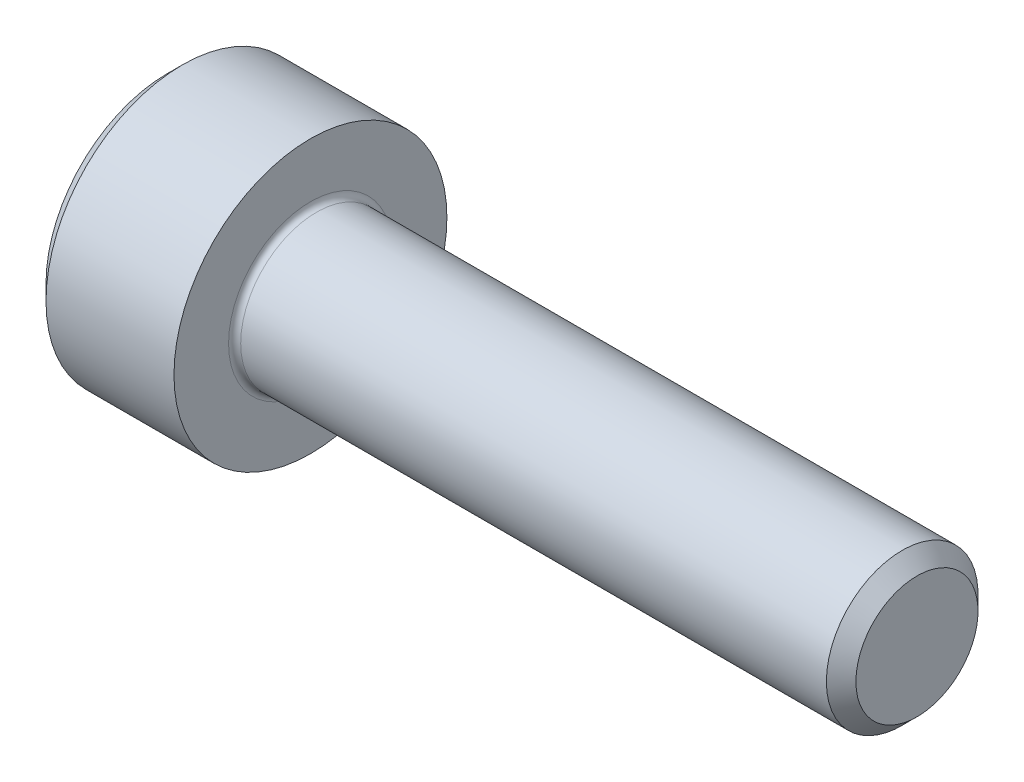
ISO-10303-21;
HEADER;
FILE_DESCRIPTION(('STEP AP214'),'2;1');
FILE_NAME('part.step','',(''),(''),'','','');
FILE_SCHEMA(('AUTOMOTIVE_DESIGN { 1 0 10303 214 1 1 1 1 }'));
ENDSEC;
DATA;
#1=APPLICATION_CONTEXT('core data for automotive mechanical design processes');
#2=APPLICATION_PROTOCOL_DEFINITION('international standard','automotive_design',2000,#1);
#3=PRODUCT_CONTEXT('',#1,'mechanical');
#4=PRODUCT('Part','Part','',(#3));
#5=PRODUCT_RELATED_PRODUCT_CATEGORY('part','',(#4));
#6=PRODUCT_DEFINITION_FORMATION('','',#4);
#7=PRODUCT_DEFINITION_CONTEXT('part definition',#1,'design');
#8=PRODUCT_DEFINITION('design','',#6,#7);
#9=PRODUCT_DEFINITION_SHAPE('','',#8);
#10=(LENGTH_UNIT() NAMED_UNIT(*) SI_UNIT(.MILLI.,.METRE.));
#11=(NAMED_UNIT(*) PLANE_ANGLE_UNIT() SI_UNIT($,.RADIAN.));
#12=(NAMED_UNIT(*) SI_UNIT($,.STERADIAN.) SOLID_ANGLE_UNIT());
#13=UNCERTAINTY_MEASURE_WITH_UNIT(LENGTH_MEASURE(1.E-05),#10,'distance_accuracy_value','');
#14=(GEOMETRIC_REPRESENTATION_CONTEXT(3) GLOBAL_UNCERTAINTY_ASSIGNED_CONTEXT((#13)) GLOBAL_UNIT_ASSIGNED_CONTEXT((#10,
#11,#12)) REPRESENTATION_CONTEXT('',''));
#15=CARTESIAN_POINT('',(0.,0.,0.));
#16=DIRECTION('',(0.,0.,1.));
#17=DIRECTION('',(1.,0.,0.));
#18=AXIS2_PLACEMENT_3D('',#15,#16,#17);
#19=CARTESIAN_POINT('',(-1.26,0.57735026918963,1.));
#20=DIRECTION('',(1.,0.,0.));
#21=DIRECTION('',(0.,0.,-1.));
#22=AXIS2_PLACEMENT_3D('',#19,#20,#21);
#23=PLANE('',#22);
#24=CARTESIAN_POINT('',(-1.26,0.,0.));
#25=DIRECTION('',(-1.,0.,0.));
#26=DIRECTION('',(0.,0.,1.));
#27=AXIS2_PLACEMENT_3D('',#24,#25,#26);
#28=CIRCLE('',#27,1.);
#29=CARTESIAN_POINT('',(-1.26,0.,1.));
#30=VERTEX_POINT('',#29);
#31=CARTESIAN_POINT('',(-1.26,0.866025403784422,0.500000000000029));
#32=VERTEX_POINT('',#31);
#33=EDGE_CURVE('E42',#30,#32,#28,.T.);
#34=ORIENTED_EDGE('',*,*,#33,.F.);
#35=DIRECTION('',(0.,-1.,0.));
#36=VECTOR('',#35,1.);
#37=CARTESIAN_POINT('',(-1.26,0.57735026918963,1.));
#38=LINE('',#37,#36);
#39=CARTESIAN_POINT('',(-1.26,0.57735026918963,1.));
#40=VERTEX_POINT('',#39);
#41=EDGE_CURVE('E155',#40,#30,#38,.T.);
#42=ORIENTED_EDGE('',*,*,#41,.F.);
#43=DIRECTION('',(0.,-0.500000000000029,0.866025403784422));
#44=VECTOR('',#43,1.);
#45=CARTESIAN_POINT('',(-1.26,1.1547005383793,0.));
#46=LINE('',#45,#44);
#47=EDGE_CURVE('E191',#32,#40,#46,.T.);
#48=ORIENTED_EDGE('',*,*,#47,.F.);
#49=EDGE_LOOP('',(#34,#42,#48));
#50=FACE_BOUND('',#49,.T.);
#51=ADVANCED_FACE('F31',(#50),#23,.F.);
#52=CARTESIAN_POINT('',(-1.26,0.866025403784422,-0.500000000000029));
#53=VERTEX_POINT('',#52);
#54=EDGE_CURVE('E11',#32,#53,#28,.T.);
#55=ORIENTED_EDGE('',*,*,#54,.F.);
#56=CARTESIAN_POINT('',(-1.26,1.1547005383793,0.));
#57=VERTEX_POINT('',#56);
#58=EDGE_CURVE('E289',#57,#32,#46,.T.);
#59=ORIENTED_EDGE('',*,*,#58,.F.);
#60=DIRECTION('',(0.,0.500000000000029,0.866025403784422));
#61=VECTOR('',#60,1.);
#62=CARTESIAN_POINT('',(-1.26,0.57735026918963,-1.));
#63=LINE('',#62,#61);
#64=EDGE_CURVE('E170',#53,#57,#63,.T.);
#65=ORIENTED_EDGE('',*,*,#64,.F.);
#66=EDGE_LOOP('',(#55,#59,#65));
#67=FACE_BOUND('',#66,.T.);
#68=ADVANCED_FACE('F119',(#67),#23,.F.);
#69=CARTESIAN_POINT('',(-1.26,0.,-1.));
#70=VERTEX_POINT('',#69);
#71=EDGE_CURVE('E40',#53,#70,#28,.T.);
#72=ORIENTED_EDGE('',*,*,#71,.F.);
#73=CARTESIAN_POINT('',(-1.26,0.57735026918963,-1.));
#74=VERTEX_POINT('',#73);
#75=EDGE_CURVE('E171',#74,#53,#63,.T.);
#76=ORIENTED_EDGE('',*,*,#75,.F.);
#77=DIRECTION('',(0.,1.,0.));
#78=VECTOR('',#77,1.);
#79=CARTESIAN_POINT('',(-1.26,-0.57735026918963,-1.));
#80=LINE('',#79,#78);
#81=EDGE_CURVE('E166',#70,#74,#80,.T.);
#82=ORIENTED_EDGE('',*,*,#81,.F.);
#83=EDGE_LOOP('',(#72,#76,#82));
#84=FACE_BOUND('',#83,.T.);
#85=ADVANCED_FACE('F125',(#84),#23,.F.);
#86=CARTESIAN_POINT('',(-1.26,-0.866025403784422,-0.500000000000029));
#87=VERTEX_POINT('',#86);
#88=EDGE_CURVE('E279',#70,#87,#28,.T.);
#89=ORIENTED_EDGE('',*,*,#88,.F.);
#90=CARTESIAN_POINT('',(-1.26,-0.57735026918963,-1.));
#91=VERTEX_POINT('',#90);
#92=EDGE_CURVE('E167',#91,#70,#80,.T.);
#93=ORIENTED_EDGE('',*,*,#92,.F.);
#94=DIRECTION('',(0.,0.500000000000029,-0.866025403784422));
#95=VECTOR('',#94,1.);
#96=CARTESIAN_POINT('',(-1.26,-1.1547005383793,0.));
#97=LINE('',#96,#95);
#98=EDGE_CURVE('E161',#87,#91,#97,.T.);
#99=ORIENTED_EDGE('',*,*,#98,.F.);
#100=EDGE_LOOP('',(#89,#93,#99));
#101=FACE_BOUND('',#100,.T.);
#102=ADVANCED_FACE('F138',(#101),#23,.F.);
#103=CARTESIAN_POINT('',(-1.26,-0.866025403784442,0.50000000000004));
#104=VERTEX_POINT('',#103);
#105=EDGE_CURVE('E49',#87,#104,#28,.T.);
#106=ORIENTED_EDGE('',*,*,#105,.F.);
#107=CARTESIAN_POINT('',(-1.26,-1.1547005383793,0.));
#108=VERTEX_POINT('',#107);
#109=EDGE_CURVE('E152',#108,#87,#97,.T.);
#110=ORIENTED_EDGE('',*,*,#109,.F.);
#111=DIRECTION('',(0.,-0.500000000000029,-0.866025403784422));
#112=VECTOR('',#111,1.);
#113=CARTESIAN_POINT('',(-1.26,-0.57735026918963,1.));
#114=LINE('',#113,#112);
#115=EDGE_CURVE('E149',#104,#108,#114,.T.);
#116=ORIENTED_EDGE('',*,*,#115,.F.);
#117=EDGE_LOOP('',(#106,#110,#116));
#118=FACE_BOUND('',#117,.T.);
#119=ADVANCED_FACE('F130',(#118),#23,.F.);
#120=EDGE_CURVE('E142',#104,#30,#28,.T.);
#121=ORIENTED_EDGE('',*,*,#120,.F.);
#122=CARTESIAN_POINT('',(-1.26,-0.57735026918963,1.));
#123=VERTEX_POINT('',#122);
#124=EDGE_CURVE('E145',#123,#104,#114,.T.);
#125=ORIENTED_EDGE('',*,*,#124,.F.);
#126=EDGE_CURVE('E146',#30,#123,#38,.T.);
#127=ORIENTED_EDGE('',*,*,#126,.F.);
#128=EDGE_LOOP('',(#121,#125,#127));
#129=FACE_BOUND('',#128,.T.);
#130=ADVANCED_FACE('F121',(#129),#23,.F.);
#131=CARTESIAN_POINT('',(-2.36,0.,0.));
#132=DIRECTION('',(1.,0.,0.));
#133=DIRECTION('',(0.,0.,-1.));
#134=AXIS2_PLACEMENT_3D('',#131,#132,#133);
#135=PLANE('',#134);
#136=CARTESIAN_POINT('',(-2.36,0.,0.));
#137=DIRECTION('',(-1.,0.,0.));
#138=DIRECTION('',(0.,0.,1.));
#139=AXIS2_PLACEMENT_3D('',#136,#137,#138);
#140=CIRCLE('',#139,2.);
#141=CARTESIAN_POINT('',(-2.36,0.,2.));
#142=VERTEX_POINT('',#141);
#143=EDGE_CURVE('E202',#142,#142,#140,.T.);
#144=ORIENTED_EDGE('',*,*,#143,.T.);
#145=EDGE_LOOP('',(#144));
#146=FACE_BOUND('',#145,.T.);
#147=DIRECTION('',(0.,-0.500000000000029,0.866025403784422));
#148=VECTOR('',#147,1.);
#149=CARTESIAN_POINT('',(-2.36,1.1547005383793,0.));
#150=LINE('',#149,#148);
#151=CARTESIAN_POINT('',(-2.36,1.1547005383793,0.));
#152=VERTEX_POINT('',#151);
#153=CARTESIAN_POINT('',(-2.36,0.57735026918963,1.));
#154=VERTEX_POINT('',#153);
#155=EDGE_CURVE('E57',#152,#154,#150,.T.);
#156=ORIENTED_EDGE('',*,*,#155,.T.);
#157=DIRECTION('',(0.,-1.,0.));
#158=VECTOR('',#157,1.);
#159=CARTESIAN_POINT('',(-2.36,0.57735026918963,1.));
#160=LINE('',#159,#158);
#161=CARTESIAN_POINT('',(-2.36,-0.57735026918963,1.));
#162=VERTEX_POINT('',#161);
#163=EDGE_CURVE('E176',#154,#162,#160,.T.);
#164=ORIENTED_EDGE('',*,*,#163,.T.);
#165=DIRECTION('',(0.,-0.500000000000029,-0.866025403784422));
#166=VECTOR('',#165,1.);
#167=CARTESIAN_POINT('',(-2.36,-0.57735026918963,1.));
#168=LINE('',#167,#166);
#169=CARTESIAN_POINT('',(-2.36,-1.1547005383793,0.));
#170=VERTEX_POINT('',#169);
#171=EDGE_CURVE('E179',#162,#170,#168,.T.);
#172=ORIENTED_EDGE('',*,*,#171,.T.);
#173=DIRECTION('',(0.,0.500000000000029,-0.866025403784422));
#174=VECTOR('',#173,1.);
#175=CARTESIAN_POINT('',(-2.36,-1.1547005383793,0.));
#176=LINE('',#175,#174);
#177=CARTESIAN_POINT('',(-2.36,-0.57735026918963,-1.));
#178=VERTEX_POINT('',#177);
#179=EDGE_CURVE('E182',#170,#178,#176,.T.);
#180=ORIENTED_EDGE('',*,*,#179,.T.);
#181=DIRECTION('',(0.,1.,0.));
#182=VECTOR('',#181,1.);
#183=CARTESIAN_POINT('',(-2.36,-0.57735026918963,-1.));
#184=LINE('',#183,#182);
#185=CARTESIAN_POINT('',(-2.36,0.57735026918963,-1.));
#186=VERTEX_POINT('',#185);
#187=EDGE_CURVE('E185',#178,#186,#184,.T.);
#188=ORIENTED_EDGE('',*,*,#187,.T.);
#189=DIRECTION('',(0.,0.500000000000029,0.866025403784422));
#190=VECTOR('',#189,1.);
#191=CARTESIAN_POINT('',(-2.36,0.57735026918963,-1.));
#192=LINE('',#191,#190);
#193=EDGE_CURVE('E188',#186,#152,#192,.T.);
#194=ORIENTED_EDGE('',*,*,#193,.T.);
#195=EDGE_LOOP('',(#156,#164,#172,#180,#188,#194));
#196=FACE_BOUND('',#195,.T.);
#197=ADVANCED_FACE('F129',(#146,#196),#135,.F.);
#198=CARTESIAN_POINT('',(10.,1.0065,0.));
#199=DIRECTION('',(-1.,0.,0.));
#200=DIRECTION('',(0.,0.,1.));
#201=AXIS2_PLACEMENT_3D('',#198,#199,#200);
#202=PLANE('',#201);
#203=CARTESIAN_POINT('',(10.,0.,0.));
#204=DIRECTION('',(-1.,0.,0.));
#205=DIRECTION('',(0.,0.,1.));
#206=AXIS2_PLACEMENT_3D('',#203,#204,#205);
#207=CIRCLE('',#206,1.0065);
#208=CARTESIAN_POINT('',(10.,0.,1.0065));
#209=VERTEX_POINT('',#208);
#210=EDGE_CURVE('E35',#209,#209,#207,.T.);
#211=ORIENTED_EDGE('',*,*,#210,.F.);
#212=EDGE_LOOP('',(#211));
#213=FACE_BOUND('',#212,.T.);
#214=ADVANCED_FACE('F33',(#213),#202,.F.);
#215=CARTESIAN_POINT('',(10.,0.,0.));
#216=DIRECTION('',(-1.,0.,0.));
#217=DIRECTION('',(0.,0.,1.));
#218=AXIS2_PLACEMENT_3D('',#215,#216,#217);
#219=CONICAL_SURFACE('',#218,1.0065,0.785398163397447);
#220=CARTESIAN_POINT('',(9.7565,0.,0.));
#221=DIRECTION('',(-1.,0.,0.));
#222=DIRECTION('',(0.,0.,1.));
#223=AXIS2_PLACEMENT_3D('',#220,#221,#222);
#224=CIRCLE('',#223,1.25);
#225=CARTESIAN_POINT('',(9.7565,0.,1.25));
#226=VERTEX_POINT('',#225);
#227=EDGE_CURVE('E216',#226,#226,#224,.T.);
#228=ORIENTED_EDGE('',*,*,#227,.F.);
#229=EDGE_LOOP('',(#228));
#230=FACE_BOUND('',#229,.T.);
#231=ORIENTED_EDGE('',*,*,#210,.T.);
#232=EDGE_LOOP('',(#231));
#233=FACE_BOUND('',#232,.T.);
#234=ADVANCED_FACE('F223',(#230,#233),#219,.T.);
#235=CARTESIAN_POINT('',(10.,0.,0.));
#236=DIRECTION('',(-1.,0.,0.));
#237=DIRECTION('',(0.,0.,1.));
#238=AXIS2_PLACEMENT_3D('',#235,#236,#237);
#239=CYLINDRICAL_SURFACE('',#238,1.25);
#240=CARTESIAN_POINT('',(0.0999999999999994,0.,0.));
#241=DIRECTION('',(-1.,0.,0.));
#242=DIRECTION('',(0.,0.,1.));
#243=AXIS2_PLACEMENT_3D('',#240,#241,#242);
#244=CIRCLE('',#243,1.25);
#245=CARTESIAN_POINT('',(0.0999999999999994,0.,1.25));
#246=VERTEX_POINT('',#245);
#247=EDGE_CURVE('E214',#246,#246,#244,.T.);
#248=ORIENTED_EDGE('',*,*,#247,.F.);
#249=EDGE_LOOP('',(#248));
#250=FACE_BOUND('',#249,.T.);
#251=ORIENTED_EDGE('',*,*,#227,.T.);
#252=EDGE_LOOP('',(#251));
#253=FACE_BOUND('',#252,.T.);
#254=ADVANCED_FACE('F229',(#250,#253),#239,.T.);
#255=CARTESIAN_POINT('',(0.0999999999999225,0.,0.));
#256=DIRECTION('',(-1.,0.,0.));
#257=DIRECTION('',(0.,0.,1.));
#258=AXIS2_PLACEMENT_3D('',#255,#256,#257);
#259=TOROIDAL_SURFACE('',#258,1.34999999999992,0.0999999999999225);
#260=CARTESIAN_POINT('',(0.,0.,0.));
#261=DIRECTION('',(-1.,0.,0.));
#262=DIRECTION('',(0.,0.,1.));
#263=AXIS2_PLACEMENT_3D('',#260,#261,#262);
#264=CIRCLE('',#263,1.35);
#265=CARTESIAN_POINT('',(0.,0.,1.35));
#266=VERTEX_POINT('',#265);
#267=EDGE_CURVE('E211',#266,#266,#264,.T.);
#268=ORIENTED_EDGE('',*,*,#267,.F.);
#269=EDGE_LOOP('',(#268));
#270=FACE_BOUND('',#269,.T.);
#271=ORIENTED_EDGE('',*,*,#247,.T.);
#272=EDGE_LOOP('',(#271));
#273=FACE_BOUND('',#272,.T.);
#274=ADVANCED_FACE('F234',(#270,#273),#259,.F.);
#275=CARTESIAN_POINT('',(0.,2.25,0.));
#276=DIRECTION('',(-1.,0.,0.));
#277=DIRECTION('',(0.,0.,1.));
#278=AXIS2_PLACEMENT_3D('',#275,#276,#277);
#279=PLANE('',#278);
#280=CARTESIAN_POINT('',(0.,0.,0.));
#281=DIRECTION('',(-1.,0.,0.));
#282=DIRECTION('',(0.,0.,1.));
#283=AXIS2_PLACEMENT_3D('',#280,#281,#282);
#284=CIRCLE('',#283,2.25);
#285=CARTESIAN_POINT('',(0.,0.,2.25));
#286=VERTEX_POINT('',#285);
#287=EDGE_CURVE('E208',#286,#286,#284,.T.);
#288=ORIENTED_EDGE('',*,*,#287,.F.);
#289=EDGE_LOOP('',(#288));
#290=FACE_BOUND('',#289,.T.);
#291=ORIENTED_EDGE('',*,*,#267,.T.);
#292=EDGE_LOOP('',(#291));
#293=FACE_BOUND('',#292,.T.);
#294=ADVANCED_FACE('F240',(#290,#293),#279,.F.);
#295=CARTESIAN_POINT('',(10.,0.,0.));
#296=DIRECTION('',(-1.,0.,0.));
#297=DIRECTION('',(0.,0.,1.));
#298=AXIS2_PLACEMENT_3D('',#295,#296,#297);
#299=CYLINDRICAL_SURFACE('',#298,2.25);
#300=CARTESIAN_POINT('',(-2.11,0.,0.));
#301=DIRECTION('',(-1.,0.,0.));
#302=DIRECTION('',(0.,0.,1.));
#303=AXIS2_PLACEMENT_3D('',#300,#301,#302);
#304=CIRCLE('',#303,2.25);
#305=CARTESIAN_POINT('',(-2.11,0.,2.25));
#306=VERTEX_POINT('',#305);
#307=EDGE_CURVE('E205',#306,#306,#304,.T.);
#308=ORIENTED_EDGE('',*,*,#307,.F.);
#309=EDGE_LOOP('',(#308));
#310=FACE_BOUND('',#309,.T.);
#311=ORIENTED_EDGE('',*,*,#287,.T.);
#312=EDGE_LOOP('',(#311));
#313=FACE_BOUND('',#312,.T.);
#314=ADVANCED_FACE('F244',(#310,#313),#299,.T.);
#315=CARTESIAN_POINT('',(-2.11,0.,0.));
#316=DIRECTION('',(1.,0.,0.));
#317=DIRECTION('',(0.,0.,-1.));
#318=AXIS2_PLACEMENT_3D('',#315,#316,#317);
#319=CONICAL_SURFACE('',#318,2.25,0.785398163397447);
#320=ORIENTED_EDGE('',*,*,#143,.F.);
#321=EDGE_LOOP('',(#320));
#322=FACE_BOUND('',#321,.T.);
#323=ORIENTED_EDGE('',*,*,#307,.T.);
#324=EDGE_LOOP('',(#323));
#325=FACE_BOUND('',#324,.T.);
#326=ADVANCED_FACE('F248',(#322,#325),#319,.T.);
#327=CARTESIAN_POINT('',(-1.26,1.1547005383793,0.));
#328=DIRECTION('',(0.,-0.866025403784422,-0.500000000000029));
#329=DIRECTION('',(0.,0.500000000000029,-0.866025403784422));
#330=AXIS2_PLACEMENT_3D('',#327,#328,#329);
#331=PLANE('',#330);
#332=ORIENTED_EDGE('',*,*,#155,.F.);
#333=DIRECTION('',(-1.,0.,0.));
#334=VECTOR('',#333,1.);
#335=CARTESIAN_POINT('',(-1.26,1.1547005383793,0.));
#336=LINE('',#335,#334);
#337=EDGE_CURVE('E174',#57,#152,#336,.T.);
#338=ORIENTED_EDGE('',*,*,#337,.F.);
#339=ORIENTED_EDGE('',*,*,#58,.T.);
#340=ORIENTED_EDGE('',*,*,#47,.T.);
#341=DIRECTION('',(-1.,0.,0.));
#342=VECTOR('',#341,1.);
#343=CARTESIAN_POINT('',(-1.26,0.57735026918963,1.));
#344=LINE('',#343,#342);
#345=EDGE_CURVE('E200',#40,#154,#344,.T.);
#346=ORIENTED_EDGE('',*,*,#345,.T.);
#347=EDGE_LOOP('',(#332,#338,#339,#340,#346));
#348=FACE_BOUND('',#347,.T.);
#349=ADVANCED_FACE('F251',(#348),#331,.T.);
#350=CARTESIAN_POINT('',(-1.26,0.57735026918963,1.));
#351=DIRECTION('',(0.,0.,-1.));
#352=DIRECTION('',(-1.,0.,0.));
#353=AXIS2_PLACEMENT_3D('',#350,#351,#352);
#354=PLANE('',#353);
#355=ORIENTED_EDGE('',*,*,#163,.F.);
#356=ORIENTED_EDGE('',*,*,#345,.F.);
#357=ORIENTED_EDGE('',*,*,#41,.T.);
#358=ORIENTED_EDGE('',*,*,#126,.T.);
#359=DIRECTION('',(-1.,0.,0.));
#360=VECTOR('',#359,1.);
#361=CARTESIAN_POINT('',(-1.26,-0.57735026918963,1.));
#362=LINE('',#361,#360);
#363=EDGE_CURVE('E160',#123,#162,#362,.T.);
#364=ORIENTED_EDGE('',*,*,#363,.T.);
#365=EDGE_LOOP('',(#355,#356,#357,#358,#364));
#366=FACE_BOUND('',#365,.T.);
#367=ADVANCED_FACE('F256',(#366),#354,.T.);
#368=CARTESIAN_POINT('',(-1.26,-0.57735026918963,1.));
#369=DIRECTION('',(0.,0.866025403784422,-0.500000000000029));
#370=DIRECTION('',(0.,0.500000000000029,0.866025403784422));
#371=AXIS2_PLACEMENT_3D('',#368,#369,#370);
#372=PLANE('',#371);
#373=ORIENTED_EDGE('',*,*,#171,.F.);
#374=ORIENTED_EDGE('',*,*,#363,.F.);
#375=ORIENTED_EDGE('',*,*,#124,.T.);
#376=ORIENTED_EDGE('',*,*,#115,.T.);
#377=DIRECTION('',(-1.,0.,0.));
#378=VECTOR('',#377,1.);
#379=CARTESIAN_POINT('',(-1.26,-1.1547005383793,0.));
#380=LINE('',#379,#378);
#381=EDGE_CURVE('E197',#108,#170,#380,.T.);
#382=ORIENTED_EDGE('',*,*,#381,.T.);
#383=EDGE_LOOP('',(#373,#374,#375,#376,#382));
#384=FACE_BOUND('',#383,.T.);
#385=ADVANCED_FACE('F159',(#384),#372,.T.);
#386=CARTESIAN_POINT('',(-1.26,-1.1547005383793,0.));
#387=DIRECTION('',(0.,0.866025403784422,0.500000000000029));
#388=DIRECTION('',(0.,-0.500000000000029,0.866025403784422));
#389=AXIS2_PLACEMENT_3D('',#386,#387,#388);
#390=PLANE('',#389);
#391=ORIENTED_EDGE('',*,*,#179,.F.);
#392=ORIENTED_EDGE('',*,*,#381,.F.);
#393=ORIENTED_EDGE('',*,*,#109,.T.);
#394=ORIENTED_EDGE('',*,*,#98,.T.);
#395=DIRECTION('',(-1.,0.,0.));
#396=VECTOR('',#395,1.);
#397=CARTESIAN_POINT('',(-1.26,-0.57735026918963,-1.));
#398=LINE('',#397,#396);
#399=EDGE_CURVE('E195',#91,#178,#398,.T.);
#400=ORIENTED_EDGE('',*,*,#399,.T.);
#401=EDGE_LOOP('',(#391,#392,#393,#394,#400));
#402=FACE_BOUND('',#401,.T.);
#403=ADVANCED_FACE('F262',(#402),#390,.T.);
#404=CARTESIAN_POINT('',(-1.26,-0.57735026918963,-1.));
#405=DIRECTION('',(0.,0.,1.));
#406=DIRECTION('',(1.,0.,0.));
#407=AXIS2_PLACEMENT_3D('',#404,#405,#406);
#408=PLANE('',#407);
#409=ORIENTED_EDGE('',*,*,#187,.F.);
#410=ORIENTED_EDGE('',*,*,#399,.F.);
#411=ORIENTED_EDGE('',*,*,#92,.T.);
#412=ORIENTED_EDGE('',*,*,#81,.T.);
#413=DIRECTION('',(-1.,0.,0.));
#414=VECTOR('',#413,1.);
#415=CARTESIAN_POINT('',(-1.26,0.57735026918963,-1.));
#416=LINE('',#415,#414);
#417=EDGE_CURVE('E193',#74,#186,#416,.T.);
#418=ORIENTED_EDGE('',*,*,#417,.T.);
#419=EDGE_LOOP('',(#409,#410,#411,#412,#418));
#420=FACE_BOUND('',#419,.T.);
#421=ADVANCED_FACE('F114',(#420),#408,.T.);
#422=CARTESIAN_POINT('',(-1.26,0.57735026918963,-1.));
#423=DIRECTION('',(0.,-0.866025403784422,0.500000000000029));
#424=DIRECTION('',(0.,-0.500000000000029,-0.866025403784422));
#425=AXIS2_PLACEMENT_3D('',#422,#423,#424);
#426=PLANE('',#425);
#427=ORIENTED_EDGE('',*,*,#193,.F.);
#428=ORIENTED_EDGE('',*,*,#417,.F.);
#429=ORIENTED_EDGE('',*,*,#75,.T.);
#430=ORIENTED_EDGE('',*,*,#64,.T.);
#431=ORIENTED_EDGE('',*,*,#337,.T.);
#432=EDGE_LOOP('',(#427,#428,#429,#430,#431));
#433=FACE_BOUND('',#432,.T.);
#434=ADVANCED_FACE('F109',(#433),#426,.T.);
#435=CARTESIAN_POINT('',(-0.68264973081037,0.,0.));
#436=DIRECTION('',(-1.,0.,0.));
#437=DIRECTION('',(0.,0.,1.));
#438=AXIS2_PLACEMENT_3D('',#435,#436,#437);
#439=CONICAL_SURFACE('',#438,0.,1.04719755119659);
#440=ORIENTED_EDGE('',*,*,#33,.T.);
#441=ORIENTED_EDGE('',*,*,#54,.T.);
#442=ORIENTED_EDGE('',*,*,#71,.T.);
#443=ORIENTED_EDGE('',*,*,#88,.T.);
#444=ORIENTED_EDGE('',*,*,#105,.T.);
#445=ORIENTED_EDGE('',*,*,#120,.T.);
#446=EDGE_LOOP('',(#440,#441,#442,#443,#444,#445));
#447=FACE_BOUND('',#446,.T.);
#448=CARTESIAN_POINT('',(-0.68264973081037,0.,0.));
#449=VERTEX_POINT('',#448);
#450=VERTEX_LOOP('',#449);
#451=FACE_BOUND('',#450,.T.);
#452=ADVANCED_FACE('F107',(#447,#451),#439,.F.);
#453=CLOSED_SHELL('',(#51,#68,#85,#102,#119,#130,#197,#214,#234,#254,#274,#294,#314,#326,#349,
#367,#385,#403,#421,#434,#452));
#454=MANIFOLD_SOLID_BREP('B2',#453);
#455=ADVANCED_BREP_SHAPE_REPRESENTATION('',(#18,#454),#14);
#456=SHAPE_DEFINITION_REPRESENTATION(#9,#455);
ENDSEC;
END-ISO-10303-21;
